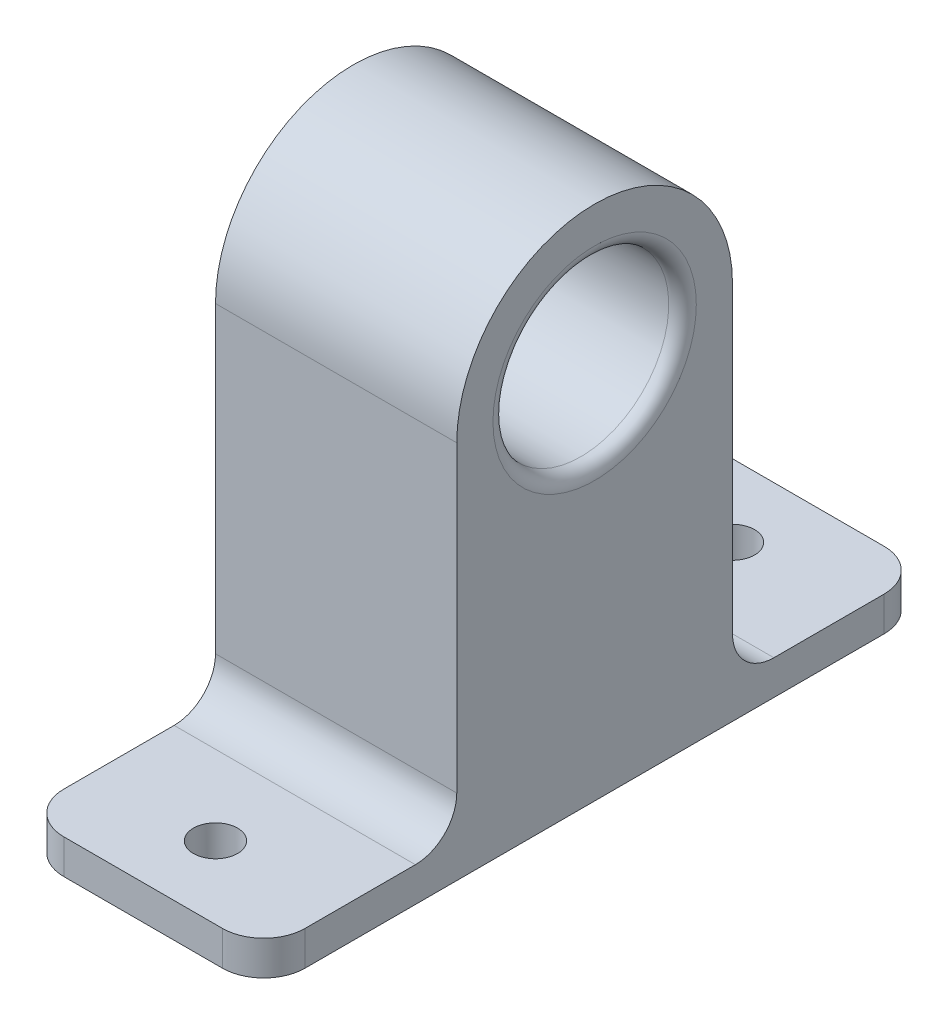
ISO-10303-21;
HEADER;
FILE_DESCRIPTION(('STEP AP214'),'2;1');
FILE_NAME('part.step','',(''),(''),'','','');
FILE_SCHEMA(('AUTOMOTIVE_DESIGN { 1 0 10303 214 1 1 1 1 }'));
ENDSEC;
DATA;
#1=APPLICATION_CONTEXT('core data for automotive mechanical design processes');
#2=APPLICATION_PROTOCOL_DEFINITION('international standard','automotive_design',2000,#1);
#3=PRODUCT_CONTEXT('',#1,'mechanical');
#4=PRODUCT('Part','Part','',(#3));
#5=PRODUCT_RELATED_PRODUCT_CATEGORY('part','',(#4));
#6=PRODUCT_DEFINITION_FORMATION('','',#4);
#7=PRODUCT_DEFINITION_CONTEXT('part definition',#1,'design');
#8=PRODUCT_DEFINITION('design','',#6,#7);
#9=PRODUCT_DEFINITION_SHAPE('','',#8);
#10=(LENGTH_UNIT() NAMED_UNIT(*) SI_UNIT(.MILLI.,.METRE.));
#11=(NAMED_UNIT(*) PLANE_ANGLE_UNIT() SI_UNIT($,.RADIAN.));
#12=(NAMED_UNIT(*) SI_UNIT($,.STERADIAN.) SOLID_ANGLE_UNIT());
#13=UNCERTAINTY_MEASURE_WITH_UNIT(LENGTH_MEASURE(1.E-05),#10,'distance_accuracy_value','');
#14=(GEOMETRIC_REPRESENTATION_CONTEXT(3) GLOBAL_UNCERTAINTY_ASSIGNED_CONTEXT((#13)) GLOBAL_UNIT_ASSIGNED_CONTEXT((#10,
#11,#12)) REPRESENTATION_CONTEXT('',''));
#15=CARTESIAN_POINT('',(0.,0.,0.));
#16=DIRECTION('',(0.,0.,1.));
#17=DIRECTION('',(1.,0.,0.));
#18=AXIS2_PLACEMENT_3D('',#15,#16,#17);
#19=CARTESIAN_POINT('',(3.,0.,0.));
#20=DIRECTION('',(-1.,0.,0.));
#21=DIRECTION('',(0.,0.,1.));
#22=AXIS2_PLACEMENT_3D('',#19,#20,#21);
#23=PLANE('',#22);
#24=CARTESIAN_POINT('',(3.,8.5,0.));
#25=DIRECTION('',(-1.,0.,0.));
#26=DIRECTION('',(0.,0.,1.));
#27=AXIS2_PLACEMENT_3D('',#24,#25,#26);
#28=CIRCLE('',#27,1.5);
#29=CARTESIAN_POINT('',(3.,8.5,1.5));
#30=VERTEX_POINT('',#29);
#31=EDGE_CURVE('E575',#30,#30,#28,.F.);
#32=ORIENTED_EDGE('',*,*,#31,.F.);
#33=EDGE_LOOP('',(#32));
#34=FACE_BOUND('',#33,.T.);
#35=CARTESIAN_POINT('',(3.,-8.5,0.));
#36=DIRECTION('',(-1.,0.,0.));
#37=DIRECTION('',(0.,0.,1.));
#38=AXIS2_PLACEMENT_3D('',#35,#36,#37);
#39=CIRCLE('',#38,1.5);
#40=CARTESIAN_POINT('',(3.,-8.5,1.5));
#41=VERTEX_POINT('',#40);
#42=EDGE_CURVE('E580',#41,#41,#39,.F.);
#43=ORIENTED_EDGE('',*,*,#42,.F.);
#44=EDGE_LOOP('',(#43));
#45=FACE_BOUND('',#44,.T.);
#46=CARTESIAN_POINT('',(3.,0.,0.));
#47=DIRECTION('',(-1.,0.,0.));
#48=DIRECTION('',(0.,0.,1.));
#49=AXIS2_PLACEMENT_3D('',#46,#47,#48);
#50=CIRCLE('',#49,12.75);
#51=CARTESIAN_POINT('',(3.,0.,12.75));
#52=VERTEX_POINT('',#51);
#53=EDGE_CURVE('E194',#52,#52,#50,.F.);
#54=ORIENTED_EDGE('',*,*,#53,.T.);
#55=EDGE_LOOP('',(#54));
#56=FACE_BOUND('',#55,.T.);
#57=CARTESIAN_POINT('',(3.,0.,0.));
#58=DIRECTION('',(-1.,0.,0.));
#59=DIRECTION('',(0.,0.,1.));
#60=AXIS2_PLACEMENT_3D('',#57,#58,#59);
#61=CIRCLE('',#60,3.75);
#62=CARTESIAN_POINT('',(3.,0.,3.75));
#63=VERTEX_POINT('',#62);
#64=EDGE_CURVE('E562',#63,#63,#61,.F.);
#65=ORIENTED_EDGE('',*,*,#64,.F.);
#66=EDGE_LOOP('',(#65));
#67=FACE_BOUND('',#66,.T.);
#68=ADVANCED_FACE('F46',(#34,#45,#56,#67),#23,.F.);
#69=CARTESIAN_POINT('',(35.,-55.,48.));
#70=DIRECTION('',(0.,1.,0.));
#71=DIRECTION('',(0.,0.,1.));
#72=AXIS2_PLACEMENT_3D('',#69,#70,#71);
#73=PLANE('',#72);
#74=CARTESIAN_POINT('',(17.5,-55.,-37.5));
#75=DIRECTION('',(0.,1.,0.));
#76=DIRECTION('',(0.,0.,1.));
#77=AXIS2_PLACEMENT_3D('',#74,#75,#76);
#78=CIRCLE('',#77,3.2);
#79=CARTESIAN_POINT('',(17.5,-55.,-34.3));
#80=VERTEX_POINT('',#79);
#81=EDGE_CURVE('E556',#80,#80,#78,.F.);
#82=ORIENTED_EDGE('',*,*,#81,.F.);
#83=EDGE_LOOP('',(#82));
#84=FACE_BOUND('',#83,.T.);
#85=CARTESIAN_POINT('',(17.5,-55.,37.5));
#86=DIRECTION('',(0.,1.,0.));
#87=DIRECTION('',(0.,0.,1.));
#88=AXIS2_PLACEMENT_3D('',#85,#86,#87);
#89=CIRCLE('',#88,3.2);
#90=CARTESIAN_POINT('',(17.5,-55.,40.7));
#91=VERTEX_POINT('',#90);
#92=EDGE_CURVE('E565',#91,#91,#89,.F.);
#93=ORIENTED_EDGE('',*,*,#92,.F.);
#94=EDGE_LOOP('',(#93));
#95=FACE_BOUND('',#94,.T.);
#96=DIRECTION('',(0.,0.,-1.));
#97=VECTOR('',#96,1.);
#98=CARTESIAN_POINT('',(35.,-55.,48.));
#99=LINE('',#98,#97);
#100=CARTESIAN_POINT('',(35.,-55.,42.));
#101=VERTEX_POINT('',#100);
#102=CARTESIAN_POINT('',(35.,-55.,-42.));
#103=VERTEX_POINT('',#102);
#104=EDGE_CURVE('E210',#101,#103,#99,.T.);
#105=ORIENTED_EDGE('',*,*,#104,.F.);
#106=CARTESIAN_POINT('',(29.,-55.,42.));
#107=DIRECTION('',(0.,1.,0.));
#108=DIRECTION('',(0.,0.,1.));
#109=AXIS2_PLACEMENT_3D('',#106,#107,#108);
#110=CIRCLE('',#109,6.);
#111=CARTESIAN_POINT('',(29.,-55.,48.));
#112=VERTEX_POINT('',#111);
#113=EDGE_CURVE('E277',#101,#112,#110,.F.);
#114=ORIENTED_EDGE('',*,*,#113,.T.);
#115=DIRECTION('',(-1.,0.,0.));
#116=VECTOR('',#115,1.);
#117=CARTESIAN_POINT('',(35.,-55.,48.));
#118=LINE('',#117,#116);
#119=CARTESIAN_POINT('',(6.,-55.,48.));
#120=VERTEX_POINT('',#119);
#121=EDGE_CURVE('E188',#112,#120,#118,.T.);
#122=ORIENTED_EDGE('',*,*,#121,.T.);
#123=CARTESIAN_POINT('',(6.,-55.,42.));
#124=DIRECTION('',(0.,1.,0.));
#125=DIRECTION('',(0.,0.,1.));
#126=AXIS2_PLACEMENT_3D('',#123,#124,#125);
#127=CIRCLE('',#126,6.);
#128=CARTESIAN_POINT('',(0.,-55.,42.));
#129=VERTEX_POINT('',#128);
#130=EDGE_CURVE('E274',#120,#129,#127,.F.);
#131=ORIENTED_EDGE('',*,*,#130,.T.);
#132=DIRECTION('',(0.,0.,-1.));
#133=VECTOR('',#132,1.);
#134=CARTESIAN_POINT('',(0.,-55.,48.));
#135=LINE('',#134,#133);
#136=CARTESIAN_POINT('',(0.,-55.,-42.));
#137=VERTEX_POINT('',#136);
#138=EDGE_CURVE('E189',#129,#137,#135,.T.);
#139=ORIENTED_EDGE('',*,*,#138,.T.);
#140=CARTESIAN_POINT('',(6.,-55.,-42.));
#141=DIRECTION('',(0.,1.,0.));
#142=DIRECTION('',(0.,0.,1.));
#143=AXIS2_PLACEMENT_3D('',#140,#141,#142);
#144=CIRCLE('',#143,6.);
#145=CARTESIAN_POINT('',(6.,-55.,-48.));
#146=VERTEX_POINT('',#145);
#147=EDGE_CURVE('E268',#137,#146,#144,.F.);
#148=ORIENTED_EDGE('',*,*,#147,.T.);
#149=DIRECTION('',(-1.,0.,0.));
#150=VECTOR('',#149,1.);
#151=CARTESIAN_POINT('',(35.,-55.,-48.));
#152=LINE('',#151,#150);
#153=CARTESIAN_POINT('',(29.,-55.,-48.));
#154=VERTEX_POINT('',#153);
#155=EDGE_CURVE('E222',#154,#146,#152,.T.);
#156=ORIENTED_EDGE('',*,*,#155,.F.);
#157=CARTESIAN_POINT('',(29.,-55.,-42.));
#158=DIRECTION('',(0.,1.,0.));
#159=DIRECTION('',(0.,0.,1.));
#160=AXIS2_PLACEMENT_3D('',#157,#158,#159);
#161=CIRCLE('',#160,6.);
#162=EDGE_CURVE('E271',#154,#103,#161,.F.);
#163=ORIENTED_EDGE('',*,*,#162,.T.);
#164=EDGE_LOOP('',(#105,#114,#122,#131,#139,#148,#156,#163));
#165=FACE_BOUND('',#164,.T.);
#166=ADVANCED_FACE('F316',(#84,#95,#165),#73,.F.);
#167=CARTESIAN_POINT('',(35.,-55.,-48.));
#168=DIRECTION('',(0.,0.,1.));
#169=DIRECTION('',(0.,-1.,0.));
#170=AXIS2_PLACEMENT_3D('',#167,#168,#169);
#171=PLANE('',#170);
#172=DIRECTION('',(-1.,0.,0.));
#173=VECTOR('',#172,1.);
#174=CARTESIAN_POINT('',(35.,-50.,-48.));
#175=LINE('',#174,#173);
#176=CARTESIAN_POINT('',(29.,-50.,-48.));
#177=VERTEX_POINT('',#176);
#178=CARTESIAN_POINT('',(6.,-50.,-48.));
#179=VERTEX_POINT('',#178);
#180=EDGE_CURVE('E172',#177,#179,#175,.T.);
#181=ORIENTED_EDGE('',*,*,#180,.F.);
#182=DIRECTION('',(0.,1.,0.));
#183=VECTOR('',#182,1.);
#184=CARTESIAN_POINT('',(29.,-55.,-48.));
#185=LINE('',#184,#183);
#186=EDGE_CURVE('E12',#177,#154,#185,.F.);
#187=ORIENTED_EDGE('',*,*,#186,.T.);
#188=ORIENTED_EDGE('',*,*,#155,.T.);
#189=DIRECTION('',(0.,1.,0.));
#190=VECTOR('',#189,1.);
#191=CARTESIAN_POINT('',(6.,-50.,-48.));
#192=LINE('',#191,#190);
#193=EDGE_CURVE('E55',#146,#179,#192,.T.);
#194=ORIENTED_EDGE('',*,*,#193,.T.);
#195=EDGE_LOOP('',(#181,#187,#188,#194));
#196=FACE_BOUND('',#195,.T.);
#197=ADVANCED_FACE('F304',(#196),#171,.F.);
#198=CARTESIAN_POINT('',(35.,-50.,-20.));
#199=DIRECTION('',(0.,-1.,0.));
#200=DIRECTION('',(0.,0.,-1.));
#201=AXIS2_PLACEMENT_3D('',#198,#199,#200);
#202=PLANE('',#201);
#203=CARTESIAN_POINT('',(17.5,-50.,-37.5));
#204=DIRECTION('',(0.,1.,0.));
#205=DIRECTION('',(0.,0.,1.));
#206=AXIS2_PLACEMENT_3D('',#203,#204,#205);
#207=CIRCLE('',#206,3.2);
#208=CARTESIAN_POINT('',(17.5,-50.,-34.3));
#209=VERTEX_POINT('',#208);
#210=EDGE_CURVE('E554',#209,#209,#207,.T.);
#211=ORIENTED_EDGE('',*,*,#210,.F.);
#212=EDGE_LOOP('',(#211));
#213=FACE_BOUND('',#212,.T.);
#214=DIRECTION('',(0.,0.,1.));
#215=VECTOR('',#214,1.);
#216=CARTESIAN_POINT('',(35.,-50.,-20.));
#217=LINE('',#216,#215);
#218=CARTESIAN_POINT('',(35.,-50.,-42.));
#219=VERTEX_POINT('',#218);
#220=CARTESIAN_POINT('',(35.,-50.,-26.));
#221=VERTEX_POINT('',#220);
#222=EDGE_CURVE('E162',#219,#221,#217,.T.);
#223=ORIENTED_EDGE('',*,*,#222,.F.);
#224=CARTESIAN_POINT('',(29.,-50.,-42.));
#225=DIRECTION('',(0.,-1.,0.));
#226=DIRECTION('',(0.,0.,-1.));
#227=AXIS2_PLACEMENT_3D('',#224,#225,#226);
#228=CIRCLE('',#227,6.);
#229=EDGE_CURVE('E70',#219,#177,#228,.F.);
#230=ORIENTED_EDGE('',*,*,#229,.T.);
#231=ORIENTED_EDGE('',*,*,#180,.T.);
#232=CARTESIAN_POINT('',(6.,-50.,-42.));
#233=DIRECTION('',(0.,-1.,0.));
#234=DIRECTION('',(0.,0.,-1.));
#235=AXIS2_PLACEMENT_3D('',#232,#233,#234);
#236=CIRCLE('',#235,6.);
#237=CARTESIAN_POINT('',(0.,-50.,-42.));
#238=VERTEX_POINT('',#237);
#239=EDGE_CURVE('E62',#179,#238,#236,.F.);
#240=ORIENTED_EDGE('',*,*,#239,.T.);
#241=DIRECTION('',(0.,0.,1.));
#242=VECTOR('',#241,1.);
#243=CARTESIAN_POINT('',(0.,-50.,-20.));
#244=LINE('',#243,#242);
#245=CARTESIAN_POINT('',(0.,-50.,-26.));
#246=VERTEX_POINT('',#245);
#247=EDGE_CURVE('E193',#238,#246,#244,.T.);
#248=ORIENTED_EDGE('',*,*,#247,.T.);
#249=DIRECTION('',(-1.,0.,0.));
#250=VECTOR('',#249,1.);
#251=CARTESIAN_POINT('',(35.,-50.,-26.));
#252=LINE('',#251,#250);
#253=EDGE_CURVE('E237',#246,#221,#252,.F.);
#254=ORIENTED_EDGE('',*,*,#253,.T.);
#255=EDGE_LOOP('',(#223,#230,#231,#240,#248,#254));
#256=FACE_BOUND('',#255,.T.);
#257=ADVANCED_FACE('F308',(#213,#256),#202,.F.);
#258=CARTESIAN_POINT('',(35.,-50.,-20.));
#259=DIRECTION('',(0.,0.,1.));
#260=DIRECTION('',(0.,-1.,0.));
#261=AXIS2_PLACEMENT_3D('',#258,#259,#260);
#262=PLANE('',#261);
#263=DIRECTION('',(0.,1.,0.));
#264=VECTOR('',#263,1.);
#265=CARTESIAN_POINT('',(35.,-50.,-20.));
#266=LINE('',#265,#264);
#267=CARTESIAN_POINT('',(35.,-44.,-20.));
#268=VERTEX_POINT('',#267);
#269=CARTESIAN_POINT('',(35.,0.,-20.));
#270=VERTEX_POINT('',#269);
#271=EDGE_CURVE('E148',#268,#270,#266,.T.);
#272=ORIENTED_EDGE('',*,*,#271,.F.);
#273=DIRECTION('',(-1.,0.,0.));
#274=VECTOR('',#273,1.);
#275=CARTESIAN_POINT('',(0.,-44.,-20.));
#276=LINE('',#275,#274);
#277=CARTESIAN_POINT('',(0.,-44.,-20.));
#278=VERTEX_POINT('',#277);
#279=EDGE_CURVE('E234',#268,#278,#276,.T.);
#280=ORIENTED_EDGE('',*,*,#279,.T.);
#281=DIRECTION('',(0.,1.,0.));
#282=VECTOR('',#281,1.);
#283=CARTESIAN_POINT('',(0.,-50.,-20.));
#284=LINE('',#283,#282);
#285=CARTESIAN_POINT('',(0.,0.,-20.));
#286=VERTEX_POINT('',#285);
#287=EDGE_CURVE('E168',#278,#286,#284,.T.);
#288=ORIENTED_EDGE('',*,*,#287,.T.);
#289=DIRECTION('',(-1.,0.,0.));
#290=VECTOR('',#289,1.);
#291=CARTESIAN_POINT('',(35.,0.,-20.));
#292=LINE('',#291,#290);
#293=EDGE_CURVE('E165',#270,#286,#292,.T.);
#294=ORIENTED_EDGE('',*,*,#293,.F.);
#295=EDGE_LOOP('',(#272,#280,#288,#294));
#296=FACE_BOUND('',#295,.T.);
#297=ADVANCED_FACE('F166',(#296),#262,.F.);
#298=CARTESIAN_POINT('',(35.,0.,0.));
#299=DIRECTION('',(-1.,0.,0.));
#300=DIRECTION('',(0.,0.,1.));
#301=AXIS2_PLACEMENT_3D('',#298,#299,#300);
#302=CYLINDRICAL_SURFACE('',#301,20.);
#303=CARTESIAN_POINT('',(0.,0.,0.));
#304=DIRECTION('',(1.,0.,0.));
#305=DIRECTION('',(0.,0.,1.));
#306=AXIS2_PLACEMENT_3D('',#303,#304,#305);
#307=CIRCLE('',#306,20.);
#308=CARTESIAN_POINT('',(0.,0.,20.));
#309=VERTEX_POINT('',#308);
#310=EDGE_CURVE('E199',#286,#309,#307,.T.);
#311=ORIENTED_EDGE('',*,*,#310,.T.);
#312=DIRECTION('',(-1.,0.,0.));
#313=VECTOR('',#312,1.);
#314=CARTESIAN_POINT('',(35.,0.,20.));
#315=LINE('',#314,#313);
#316=CARTESIAN_POINT('',(35.,0.,20.));
#317=VERTEX_POINT('',#316);
#318=EDGE_CURVE('E173',#317,#309,#315,.T.);
#319=ORIENTED_EDGE('',*,*,#318,.F.);
#320=CARTESIAN_POINT('',(35.,0.,0.));
#321=DIRECTION('',(1.,0.,0.));
#322=DIRECTION('',(0.,0.,1.));
#323=AXIS2_PLACEMENT_3D('',#320,#321,#322);
#324=CIRCLE('',#323,20.);
#325=EDGE_CURVE('E154',#270,#317,#324,.T.);
#326=ORIENTED_EDGE('',*,*,#325,.F.);
#327=ORIENTED_EDGE('',*,*,#293,.T.);
#328=EDGE_LOOP('',(#311,#319,#326,#327));
#329=FACE_BOUND('',#328,.T.);
#330=ADVANCED_FACE('F175',(#329),#302,.T.);
#331=CARTESIAN_POINT('',(35.,0.,20.));
#332=DIRECTION('',(0.,0.,-1.));
#333=DIRECTION('',(0.,1.,0.));
#334=AXIS2_PLACEMENT_3D('',#331,#332,#333);
#335=PLANE('',#334);
#336=DIRECTION('',(0.,-1.,0.));
#337=VECTOR('',#336,1.);
#338=CARTESIAN_POINT('',(0.,0.,20.));
#339=LINE('',#338,#337);
#340=CARTESIAN_POINT('',(0.,-44.,20.));
#341=VERTEX_POINT('',#340);
#342=EDGE_CURVE('E202',#309,#341,#339,.T.);
#343=ORIENTED_EDGE('',*,*,#342,.T.);
#344=DIRECTION('',(-1.,0.,0.));
#345=VECTOR('',#344,1.);
#346=CARTESIAN_POINT('',(35.,-44.,20.));
#347=LINE('',#346,#345);
#348=CARTESIAN_POINT('',(35.,-44.,20.));
#349=VERTEX_POINT('',#348);
#350=EDGE_CURVE('E245',#341,#349,#347,.F.);
#351=ORIENTED_EDGE('',*,*,#350,.T.);
#352=DIRECTION('',(0.,-1.,0.));
#353=VECTOR('',#352,1.);
#354=CARTESIAN_POINT('',(35.,0.,20.));
#355=LINE('',#354,#353);
#356=EDGE_CURVE('E179',#317,#349,#355,.T.);
#357=ORIENTED_EDGE('',*,*,#356,.F.);
#358=ORIENTED_EDGE('',*,*,#318,.T.);
#359=EDGE_LOOP('',(#343,#351,#357,#358));
#360=FACE_BOUND('',#359,.T.);
#361=ADVANCED_FACE('F344',(#360),#335,.F.);
#362=CARTESIAN_POINT('',(35.,-50.,20.));
#363=DIRECTION('',(0.,-1.,0.));
#364=DIRECTION('',(0.,0.,-1.));
#365=AXIS2_PLACEMENT_3D('',#362,#363,#364);
#366=PLANE('',#365);
#367=CARTESIAN_POINT('',(17.5,-50.,37.5));
#368=DIRECTION('',(0.,1.,0.));
#369=DIRECTION('',(0.,0.,-1.));
#370=AXIS2_PLACEMENT_3D('',#367,#368,#369);
#371=CIRCLE('',#370,3.2);
#372=CARTESIAN_POINT('',(17.5,-50.,34.3));
#373=VERTEX_POINT('',#372);
#374=EDGE_CURVE('E557',#373,#373,#371,.T.);
#375=ORIENTED_EDGE('',*,*,#374,.F.);
#376=EDGE_LOOP('',(#375));
#377=FACE_BOUND('',#376,.T.);
#378=DIRECTION('',(-1.,0.,0.));
#379=VECTOR('',#378,1.);
#380=CARTESIAN_POINT('',(35.,-50.,48.));
#381=LINE('',#380,#379);
#382=CARTESIAN_POINT('',(29.,-50.,48.));
#383=VERTEX_POINT('',#382);
#384=CARTESIAN_POINT('',(6.,-50.,48.));
#385=VERTEX_POINT('',#384);
#386=EDGE_CURVE('E214',#383,#385,#381,.T.);
#387=ORIENTED_EDGE('',*,*,#386,.F.);
#388=CARTESIAN_POINT('',(29.,-50.,42.));
#389=DIRECTION('',(0.,-1.,0.));
#390=DIRECTION('',(0.,0.,-1.));
#391=AXIS2_PLACEMENT_3D('',#388,#389,#390);
#392=CIRCLE('',#391,6.);
#393=CARTESIAN_POINT('',(35.,-50.,42.));
#394=VERTEX_POINT('',#393);
#395=EDGE_CURVE('E290',#383,#394,#392,.F.);
#396=ORIENTED_EDGE('',*,*,#395,.T.);
#397=DIRECTION('',(0.,0.,1.));
#398=VECTOR('',#397,1.);
#399=CARTESIAN_POINT('',(35.,-50.,20.));
#400=LINE('',#399,#398);
#401=CARTESIAN_POINT('',(35.,-50.,26.));
#402=VERTEX_POINT('',#401);
#403=EDGE_CURVE('E182',#402,#394,#400,.T.);
#404=ORIENTED_EDGE('',*,*,#403,.F.);
#405=DIRECTION('',(-1.,0.,0.));
#406=VECTOR('',#405,1.);
#407=CARTESIAN_POINT('',(0.,-50.,26.));
#408=LINE('',#407,#406);
#409=CARTESIAN_POINT('',(0.,-50.,26.));
#410=VERTEX_POINT('',#409);
#411=EDGE_CURVE('E241',#402,#410,#408,.T.);
#412=ORIENTED_EDGE('',*,*,#411,.T.);
#413=DIRECTION('',(0.,0.,1.));
#414=VECTOR('',#413,1.);
#415=CARTESIAN_POINT('',(0.,-50.,20.));
#416=LINE('',#415,#414);
#417=CARTESIAN_POINT('',(0.,-50.,42.));
#418=VERTEX_POINT('',#417);
#419=EDGE_CURVE('E206',#410,#418,#416,.T.);
#420=ORIENTED_EDGE('',*,*,#419,.T.);
#421=CARTESIAN_POINT('',(6.,-50.,42.));
#422=DIRECTION('',(0.,-1.,0.));
#423=DIRECTION('',(0.,0.,-1.));
#424=AXIS2_PLACEMENT_3D('',#421,#422,#423);
#425=CIRCLE('',#424,6.);
#426=EDGE_CURVE('E287',#418,#385,#425,.F.);
#427=ORIENTED_EDGE('',*,*,#426,.T.);
#428=EDGE_LOOP('',(#387,#396,#404,#412,#420,#427));
#429=FACE_BOUND('',#428,.T.);
#430=ADVANCED_FACE('F326',(#377,#429),#366,.F.);
#431=CARTESIAN_POINT('',(35.,-55.,48.));
#432=DIRECTION('',(0.,0.,-1.));
#433=DIRECTION('',(0.,1.,0.));
#434=AXIS2_PLACEMENT_3D('',#431,#432,#433);
#435=PLANE('',#434);
#436=ORIENTED_EDGE('',*,*,#121,.F.);
#437=DIRECTION('',(0.,-1.,0.));
#438=VECTOR('',#437,1.);
#439=CARTESIAN_POINT('',(29.,-55.,48.));
#440=LINE('',#439,#438);
#441=EDGE_CURVE('E284',#112,#383,#440,.F.);
#442=ORIENTED_EDGE('',*,*,#441,.T.);
#443=ORIENTED_EDGE('',*,*,#386,.T.);
#444=DIRECTION('',(0.,-1.,0.));
#445=VECTOR('',#444,1.);
#446=CARTESIAN_POINT('',(6.,-55.,48.));
#447=LINE('',#446,#445);
#448=EDGE_CURVE('E280',#385,#120,#447,.T.);
#449=ORIENTED_EDGE('',*,*,#448,.T.);
#450=EDGE_LOOP('',(#436,#442,#443,#449));
#451=FACE_BOUND('',#450,.T.);
#452=ADVANCED_FACE('F330',(#451),#435,.F.);
#453=CARTESIAN_POINT('',(35.,0.,0.));
#454=DIRECTION('',(-1.,0.,0.));
#455=DIRECTION('',(0.,0.,1.));
#456=AXIS2_PLACEMENT_3D('',#453,#454,#455);
#457=PLANE('',#456);
#458=CARTESIAN_POINT('',(35.,0.,0.));
#459=DIRECTION('',(-1.,0.,0.));
#460=DIRECTION('',(0.,0.,1.));
#461=AXIS2_PLACEMENT_3D('',#458,#459,#460);
#462=CIRCLE('',#461,14.75);
#463=CARTESIAN_POINT('',(35.,0.,14.75));
#464=VERTEX_POINT('',#463);
#465=EDGE_CURVE('E230',#464,#464,#462,.T.);
#466=ORIENTED_EDGE('',*,*,#465,.T.);
#467=EDGE_LOOP('',(#466));
#468=FACE_BOUND('',#467,.T.);
#469=ORIENTED_EDGE('',*,*,#403,.T.);
#470=DIRECTION('',(0.,-1.,0.));
#471=VECTOR('',#470,1.);
#472=CARTESIAN_POINT('',(35.,0.,41.9999999999999));
#473=LINE('',#472,#471);
#474=EDGE_CURVE('E264',#394,#101,#473,.T.);
#475=ORIENTED_EDGE('',*,*,#474,.T.);
#476=ORIENTED_EDGE('',*,*,#104,.T.);
#477=DIRECTION('',(0.,1.,0.));
#478=VECTOR('',#477,1.);
#479=CARTESIAN_POINT('',(35.,0.,-41.9999999999999));
#480=LINE('',#479,#478);
#481=EDGE_CURVE('E260',#103,#219,#480,.T.);
#482=ORIENTED_EDGE('',*,*,#481,.T.);
#483=ORIENTED_EDGE('',*,*,#222,.T.);
#484=CARTESIAN_POINT('',(35.,-44.,-26.));
#485=DIRECTION('',(-1.,0.,0.));
#486=DIRECTION('',(0.,0.,1.));
#487=AXIS2_PLACEMENT_3D('',#484,#485,#486);
#488=CIRCLE('',#487,6.);
#489=EDGE_CURVE('E157',#221,#268,#488,.T.);
#490=ORIENTED_EDGE('',*,*,#489,.T.);
#491=ORIENTED_EDGE('',*,*,#271,.T.);
#492=ORIENTED_EDGE('',*,*,#325,.T.);
#493=ORIENTED_EDGE('',*,*,#356,.T.);
#494=CARTESIAN_POINT('',(35.,-44.,26.));
#495=DIRECTION('',(-1.,0.,0.));
#496=DIRECTION('',(0.,0.,1.));
#497=AXIS2_PLACEMENT_3D('',#494,#495,#496);
#498=CIRCLE('',#497,6.);
#499=EDGE_CURVE('E257',#349,#402,#498,.T.);
#500=ORIENTED_EDGE('',*,*,#499,.T.);
#501=EDGE_LOOP('',(#469,#475,#476,#482,#483,#490,#491,#492,#493,#500));
#502=FACE_BOUND('',#501,.T.);
#503=ADVANCED_FACE('F151',(#468,#502),#457,.F.);
#504=CARTESIAN_POINT('',(0.,0.,0.));
#505=DIRECTION('',(-1.,0.,0.));
#506=DIRECTION('',(0.,0.,1.));
#507=AXIS2_PLACEMENT_3D('',#504,#505,#506);
#508=PLANE('',#507);
#509=CARTESIAN_POINT('',(0.,8.5,0.));
#510=DIRECTION('',(-1.,0.,0.));
#511=DIRECTION('',(0.,0.,1.));
#512=AXIS2_PLACEMENT_3D('',#509,#510,#511);
#513=CIRCLE('',#512,1.5);
#514=CARTESIAN_POINT('',(0.,8.5,1.5));
#515=VERTEX_POINT('',#514);
#516=EDGE_CURVE('E571',#515,#515,#513,.T.);
#517=ORIENTED_EDGE('',*,*,#516,.F.);
#518=EDGE_LOOP('',(#517));
#519=FACE_BOUND('',#518,.T.);
#520=CARTESIAN_POINT('',(0.,-8.5,0.));
#521=DIRECTION('',(-1.,0.,0.));
#522=DIRECTION('',(0.,0.,1.));
#523=AXIS2_PLACEMENT_3D('',#520,#521,#522);
#524=CIRCLE('',#523,1.5);
#525=CARTESIAN_POINT('',(0.,-8.5,1.5));
#526=VERTEX_POINT('',#525);
#527=EDGE_CURVE('E576',#526,#526,#524,.T.);
#528=ORIENTED_EDGE('',*,*,#527,.F.);
#529=EDGE_LOOP('',(#528));
#530=FACE_BOUND('',#529,.T.);
#531=CARTESIAN_POINT('',(0.,0.,0.));
#532=DIRECTION('',(-1.,0.,0.));
#533=DIRECTION('',(0.,0.,1.));
#534=AXIS2_PLACEMENT_3D('',#531,#532,#533);
#535=CIRCLE('',#534,3.75);
#536=CARTESIAN_POINT('',(0.,0.,3.75));
#537=VERTEX_POINT('',#536);
#538=EDGE_CURVE('E584',#537,#537,#535,.T.);
#539=ORIENTED_EDGE('',*,*,#538,.F.);
#540=EDGE_LOOP('',(#539));
#541=FACE_BOUND('',#540,.T.);
#542=ORIENTED_EDGE('',*,*,#138,.F.);
#543=DIRECTION('',(0.,-1.,0.));
#544=VECTOR('',#543,1.);
#545=CARTESIAN_POINT('',(0.,-50.,42.));
#546=LINE('',#545,#544);
#547=EDGE_CURVE('E296',#129,#418,#546,.F.);
#548=ORIENTED_EDGE('',*,*,#547,.T.);
#549=ORIENTED_EDGE('',*,*,#419,.F.);
#550=CARTESIAN_POINT('',(0.,-44.,26.));
#551=DIRECTION('',(-1.,0.,0.));
#552=DIRECTION('',(0.,0.,1.));
#553=AXIS2_PLACEMENT_3D('',#550,#551,#552);
#554=CIRCLE('',#553,6.);
#555=EDGE_CURVE('E254',#410,#341,#554,.F.);
#556=ORIENTED_EDGE('',*,*,#555,.T.);
#557=ORIENTED_EDGE('',*,*,#342,.F.);
#558=ORIENTED_EDGE('',*,*,#310,.F.);
#559=ORIENTED_EDGE('',*,*,#287,.F.);
#560=CARTESIAN_POINT('',(0.,-44.,-26.));
#561=DIRECTION('',(-1.,0.,0.));
#562=DIRECTION('',(0.,0.,1.));
#563=AXIS2_PLACEMENT_3D('',#560,#561,#562);
#564=CIRCLE('',#563,6.);
#565=EDGE_CURVE('E248',#278,#246,#564,.F.);
#566=ORIENTED_EDGE('',*,*,#565,.T.);
#567=ORIENTED_EDGE('',*,*,#247,.F.);
#568=DIRECTION('',(0.,1.,0.));
#569=VECTOR('',#568,1.);
#570=CARTESIAN_POINT('',(0.,-55.,-42.));
#571=LINE('',#570,#569);
#572=EDGE_CURVE('E293',#238,#137,#571,.F.);
#573=ORIENTED_EDGE('',*,*,#572,.T.);
#574=EDGE_LOOP('',(#542,#548,#549,#556,#557,#558,#559,#566,#567,#573));
#575=FACE_BOUND('',#574,.T.);
#576=ADVANCED_FACE('F312',(#519,#530,#541,#575),#508,.T.);
#577=CARTESIAN_POINT('',(-36.0624458405139,0.,0.));
#578=DIRECTION('',(1.,0.,0.));
#579=DIRECTION('',(0.,0.,-1.));
#580=AXIS2_PLACEMENT_3D('',#577,#578,#579);
#581=CYLINDRICAL_SURFACE('',#580,12.75);
#582=CARTESIAN_POINT('',(33.,0.,0.));
#583=DIRECTION('',(-1.,0.,0.));
#584=DIRECTION('',(0.,0.,1.));
#585=AXIS2_PLACEMENT_3D('',#582,#583,#584);
#586=CIRCLE('',#585,12.75);
#587=CARTESIAN_POINT('',(33.,0.,12.75));
#588=VERTEX_POINT('',#587);
#589=EDGE_CURVE('E226',#588,#588,#586,.F.);
#590=ORIENTED_EDGE('',*,*,#589,.T.);
#591=EDGE_LOOP('',(#590));
#592=FACE_BOUND('',#591,.T.);
#593=ORIENTED_EDGE('',*,*,#53,.F.);
#594=EDGE_LOOP('',(#593));
#595=FACE_BOUND('',#594,.T.);
#596=ADVANCED_FACE('F369',(#592,#595),#581,.F.);
#597=CARTESIAN_POINT('',(35.001,-8.5,0.));
#598=DIRECTION('',(-1.,0.,0.));
#599=DIRECTION('',(0.,0.,1.));
#600=AXIS2_PLACEMENT_3D('',#597,#598,#599);
#601=CYLINDRICAL_SURFACE('',#600,1.5);
#602=ORIENTED_EDGE('',*,*,#527,.T.);
#603=EDGE_LOOP('',(#602));
#604=FACE_BOUND('',#603,.T.);
#605=ORIENTED_EDGE('',*,*,#42,.T.);
#606=EDGE_LOOP('',(#605));
#607=FACE_BOUND('',#606,.T.);
#608=ADVANCED_FACE('F485',(#604,#607),#601,.F.);
#609=CARTESIAN_POINT('',(35.001,8.5,0.));
#610=DIRECTION('',(-1.,0.,0.));
#611=DIRECTION('',(0.,0.,1.));
#612=AXIS2_PLACEMENT_3D('',#609,#610,#611);
#613=CYLINDRICAL_SURFACE('',#612,1.5);
#614=ORIENTED_EDGE('',*,*,#516,.T.);
#615=EDGE_LOOP('',(#614));
#616=FACE_BOUND('',#615,.T.);
#617=ORIENTED_EDGE('',*,*,#31,.T.);
#618=EDGE_LOOP('',(#617));
#619=FACE_BOUND('',#618,.T.);
#620=ADVANCED_FACE('F477',(#616,#619),#613,.F.);
#621=CARTESIAN_POINT('',(35.001,0.,0.));
#622=DIRECTION('',(-1.,0.,0.));
#623=DIRECTION('',(0.,0.,1.));
#624=AXIS2_PLACEMENT_3D('',#621,#622,#623);
#625=CYLINDRICAL_SURFACE('',#624,3.75);
#626=ORIENTED_EDGE('',*,*,#538,.T.);
#627=EDGE_LOOP('',(#626));
#628=FACE_BOUND('',#627,.T.);
#629=ORIENTED_EDGE('',*,*,#64,.T.);
#630=EDGE_LOOP('',(#629));
#631=FACE_BOUND('',#630,.T.);
#632=ADVANCED_FACE('F468',(#628,#631),#625,.F.);
#633=CARTESIAN_POINT('',(17.5,-55.001,37.5));
#634=DIRECTION('',(0.,1.,0.));
#635=DIRECTION('',(0.,0.,1.));
#636=AXIS2_PLACEMENT_3D('',#633,#634,#635);
#637=CYLINDRICAL_SURFACE('',#636,3.2);
#638=ORIENTED_EDGE('',*,*,#374,.T.);
#639=EDGE_LOOP('',(#638));
#640=FACE_BOUND('',#639,.T.);
#641=ORIENTED_EDGE('',*,*,#92,.T.);
#642=EDGE_LOOP('',(#641));
#643=FACE_BOUND('',#642,.T.);
#644=ADVANCED_FACE('F459',(#640,#643),#637,.F.);
#645=CARTESIAN_POINT('',(17.5,-55.001,-37.5));
#646=DIRECTION('',(0.,1.,0.));
#647=DIRECTION('',(0.,0.,1.));
#648=AXIS2_PLACEMENT_3D('',#645,#646,#647);
#649=CYLINDRICAL_SURFACE('',#648,3.2);
#650=ORIENTED_EDGE('',*,*,#210,.T.);
#651=EDGE_LOOP('',(#650));
#652=FACE_BOUND('',#651,.T.);
#653=ORIENTED_EDGE('',*,*,#81,.T.);
#654=EDGE_LOOP('',(#653));
#655=FACE_BOUND('',#654,.T.);
#656=ADVANCED_FACE('F450',(#652,#655),#649,.F.);
#657=CARTESIAN_POINT('',(33.,0.,0.));
#658=DIRECTION('',(-1.,0.,0.));
#659=DIRECTION('',(0.,0.,1.));
#660=AXIS2_PLACEMENT_3D('',#657,#658,#659);
#661=TOROIDAL_SURFACE('',#660,14.75,2.);
#662=ORIENTED_EDGE('',*,*,#465,.F.);
#663=EDGE_LOOP('',(#662));
#664=FACE_BOUND('',#663,.T.);
#665=ORIENTED_EDGE('',*,*,#589,.F.);
#666=EDGE_LOOP('',(#665));
#667=FACE_BOUND('',#666,.T.);
#668=ADVANCED_FACE('F441',(#664,#667),#661,.T.);
#669=CARTESIAN_POINT('',(35.,-44.,-26.));
#670=DIRECTION('',(1.,0.,0.));
#671=DIRECTION('',(0.,0.,-1.));
#672=AXIS2_PLACEMENT_3D('',#669,#670,#671);
#673=CYLINDRICAL_SURFACE('',#672,6.);
#674=ORIENTED_EDGE('',*,*,#489,.F.);
#675=ORIENTED_EDGE('',*,*,#253,.F.);
#676=ORIENTED_EDGE('',*,*,#565,.F.);
#677=ORIENTED_EDGE('',*,*,#279,.F.);
#678=EDGE_LOOP('',(#674,#675,#676,#677));
#679=FACE_BOUND('',#678,.T.);
#680=ADVANCED_FACE('F434',(#679),#673,.F.);
#681=CARTESIAN_POINT('',(35.,-44.,26.));
#682=DIRECTION('',(1.,0.,0.));
#683=DIRECTION('',(0.,0.,-1.));
#684=AXIS2_PLACEMENT_3D('',#681,#682,#683);
#685=CYLINDRICAL_SURFACE('',#684,6.);
#686=ORIENTED_EDGE('',*,*,#499,.F.);
#687=ORIENTED_EDGE('',*,*,#350,.F.);
#688=ORIENTED_EDGE('',*,*,#555,.F.);
#689=ORIENTED_EDGE('',*,*,#411,.F.);
#690=EDGE_LOOP('',(#686,#687,#688,#689));
#691=FACE_BOUND('',#690,.T.);
#692=ADVANCED_FACE('F341',(#691),#685,.F.);
#693=CARTESIAN_POINT('',(29.,0.,41.9999999999999));
#694=DIRECTION('',(0.,-1.,0.));
#695=DIRECTION('',(0.,0.,-1.));
#696=AXIS2_PLACEMENT_3D('',#693,#694,#695);
#697=CYLINDRICAL_SURFACE('',#696,6.);
#698=ORIENTED_EDGE('',*,*,#395,.F.);
#699=ORIENTED_EDGE('',*,*,#441,.F.);
#700=ORIENTED_EDGE('',*,*,#113,.F.);
#701=ORIENTED_EDGE('',*,*,#474,.F.);
#702=EDGE_LOOP('',(#698,#699,#700,#701));
#703=FACE_BOUND('',#702,.T.);
#704=ADVANCED_FACE('F333',(#703),#697,.T.);
#705=CARTESIAN_POINT('',(6.,-55.,42.));
#706=DIRECTION('',(0.,1.,0.));
#707=DIRECTION('',(0.,0.,1.));
#708=AXIS2_PLACEMENT_3D('',#705,#706,#707);
#709=CYLINDRICAL_SURFACE('',#708,6.);
#710=ORIENTED_EDGE('',*,*,#426,.F.);
#711=ORIENTED_EDGE('',*,*,#547,.F.);
#712=ORIENTED_EDGE('',*,*,#130,.F.);
#713=ORIENTED_EDGE('',*,*,#448,.F.);
#714=EDGE_LOOP('',(#710,#711,#712,#713));
#715=FACE_BOUND('',#714,.T.);
#716=ADVANCED_FACE('F322',(#715),#709,.T.);
#717=CARTESIAN_POINT('',(29.,0.,-41.9999999999999));
#718=DIRECTION('',(0.,1.,0.));
#719=DIRECTION('',(0.,0.,1.));
#720=AXIS2_PLACEMENT_3D('',#717,#718,#719);
#721=CYLINDRICAL_SURFACE('',#720,6.);
#722=ORIENTED_EDGE('',*,*,#162,.F.);
#723=ORIENTED_EDGE('',*,*,#186,.F.);
#724=ORIENTED_EDGE('',*,*,#229,.F.);
#725=ORIENTED_EDGE('',*,*,#481,.F.);
#726=EDGE_LOOP('',(#722,#723,#724,#725));
#727=FACE_BOUND('',#726,.T.);
#728=ADVANCED_FACE('F409',(#727),#721,.T.);
#729=CARTESIAN_POINT('',(6.,-55.,-42.));
#730=DIRECTION('',(0.,-1.,0.));
#731=DIRECTION('',(0.,0.,-1.));
#732=AXIS2_PLACEMENT_3D('',#729,#730,#731);
#733=CYLINDRICAL_SURFACE('',#732,6.);
#734=ORIENTED_EDGE('',*,*,#147,.F.);
#735=ORIENTED_EDGE('',*,*,#572,.F.);
#736=ORIENTED_EDGE('',*,*,#239,.F.);
#737=ORIENTED_EDGE('',*,*,#193,.F.);
#738=EDGE_LOOP('',(#734,#735,#736,#737));
#739=FACE_BOUND('',#738,.T.);
#740=ADVANCED_FACE('F48',(#739),#733,.T.);
#741=CLOSED_SHELL('',(#68,#166,#197,#257,#297,#330,#361,#430,#452,#503,#576,#596,#608,#620,#632,
#644,#656,#668,#680,#692,#704,#716,#728,#740));
#742=MANIFOLD_SOLID_BREP('B2',#741);
#743=ADVANCED_BREP_SHAPE_REPRESENTATION('',(#18,#742),#14);
#744=SHAPE_DEFINITION_REPRESENTATION(#9,#743);
ENDSEC;
END-ISO-10303-21;
